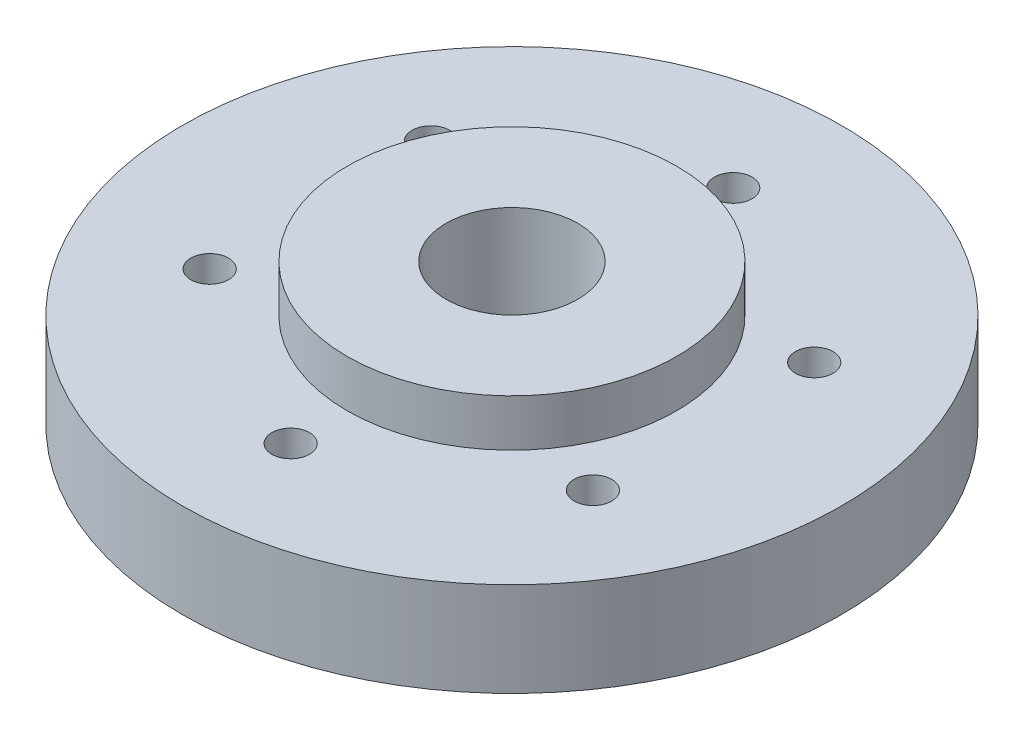
ISO-10303-21;
HEADER;
FILE_DESCRIPTION(('STEP AP214'),'2;1');
FILE_NAME('part.step','',(''),(''),'','','');
FILE_SCHEMA(('AUTOMOTIVE_DESIGN { 1 0 10303 214 1 1 1 1 }'));
ENDSEC;
DATA;
#1=APPLICATION_CONTEXT('core data for automotive mechanical design processes');
#2=APPLICATION_PROTOCOL_DEFINITION('international standard','automotive_design',2000,#1);
#3=PRODUCT_CONTEXT('',#1,'mechanical');
#4=PRODUCT('Part','Part','',(#3));
#5=PRODUCT_RELATED_PRODUCT_CATEGORY('part','',(#4));
#6=PRODUCT_DEFINITION_FORMATION('','',#4);
#7=PRODUCT_DEFINITION_CONTEXT('part definition',#1,'design');
#8=PRODUCT_DEFINITION('design','',#6,#7);
#9=PRODUCT_DEFINITION_SHAPE('','',#8);
#10=(LENGTH_UNIT() NAMED_UNIT(*) SI_UNIT(.MILLI.,.METRE.));
#11=(NAMED_UNIT(*) PLANE_ANGLE_UNIT() SI_UNIT($,.RADIAN.));
#12=(NAMED_UNIT(*) SI_UNIT($,.STERADIAN.) SOLID_ANGLE_UNIT());
#13=UNCERTAINTY_MEASURE_WITH_UNIT(LENGTH_MEASURE(1.E-05),#10,'distance_accuracy_value','');
#14=(GEOMETRIC_REPRESENTATION_CONTEXT(3) GLOBAL_UNCERTAINTY_ASSIGNED_CONTEXT((#13)) GLOBAL_UNIT_ASSIGNED_CONTEXT((#10,
#11,#12)) REPRESENTATION_CONTEXT('',''));
#15=CARTESIAN_POINT('',(0.,0.,0.));
#16=DIRECTION('',(0.,0.,1.));
#17=DIRECTION('',(1.,0.,0.));
#18=AXIS2_PLACEMENT_3D('',#15,#16,#17);
#19=CARTESIAN_POINT('',(0.,0.,-23.5));
#20=DIRECTION('',(0.,1.,0.));
#21=DIRECTION('',(0.,0.,1.));
#22=AXIS2_PLACEMENT_3D('',#19,#20,#21);
#23=CYLINDRICAL_SURFACE('',#22,2.);
#24=CARTESIAN_POINT('',(0.,10.,-23.5));
#25=DIRECTION('',(0.,1.,0.));
#26=DIRECTION('',(0.,0.,1.));
#27=AXIS2_PLACEMENT_3D('',#24,#25,#26);
#28=CIRCLE('',#27,2.);
#29=CARTESIAN_POINT('',(0.,10.,-21.5));
#30=VERTEX_POINT('',#29);
#31=EDGE_CURVE('E61',#30,#30,#28,.T.);
#32=ORIENTED_EDGE('',*,*,#31,.T.);
#33=EDGE_LOOP('',(#32));
#34=FACE_BOUND('',#33,.T.);
#35=CARTESIAN_POINT('',(0.,5.,-23.5));
#36=DIRECTION('',(0.,-1.,0.));
#37=DIRECTION('',(0.,0.,-1.));
#38=AXIS2_PLACEMENT_3D('',#35,#36,#37);
#39=CIRCLE('',#38,2.);
#40=CARTESIAN_POINT('',(0.,5.,-25.5));
#41=VERTEX_POINT('',#40);
#42=EDGE_CURVE('E107',#41,#41,#39,.T.);
#43=ORIENTED_EDGE('',*,*,#42,.T.);
#44=EDGE_LOOP('',(#43));
#45=FACE_BOUND('',#44,.T.);
#46=ADVANCED_FACE('F31',(#34,#45),#23,.F.);
#47=CARTESIAN_POINT('',(-20.3515969889338,0.,-11.7499999999991));
#48=DIRECTION('',(0.,1.,0.));
#49=DIRECTION('',(0.,0.,1.));
#50=AXIS2_PLACEMENT_3D('',#47,#48,#49);
#51=CYLINDRICAL_SURFACE('',#50,2.00000000000101);
#52=CARTESIAN_POINT('',(-20.3515969889338,10.,-11.7499999999991));
#53=DIRECTION('',(0.,1.,0.));
#54=DIRECTION('',(0.,0.,1.));
#55=AXIS2_PLACEMENT_3D('',#52,#53,#54);
#56=CIRCLE('',#55,2.00000000000101);
#57=CARTESIAN_POINT('',(-20.3515969889338,10.,-9.74999999999811));
#58=VERTEX_POINT('',#57);
#59=EDGE_CURVE('E67',#58,#58,#56,.T.);
#60=ORIENTED_EDGE('',*,*,#59,.T.);
#61=EDGE_LOOP('',(#60));
#62=FACE_BOUND('',#61,.T.);
#63=CARTESIAN_POINT('',(-20.3515969889338,5.,-11.7499999999991));
#64=DIRECTION('',(0.,-1.,0.));
#65=DIRECTION('',(0.,0.,-1.));
#66=AXIS2_PLACEMENT_3D('',#63,#64,#65);
#67=CIRCLE('',#66,2.00000000000101);
#68=CARTESIAN_POINT('',(-20.3515969889338,5.,-13.7500000000001));
#69=VERTEX_POINT('',#68);
#70=EDGE_CURVE('E98',#69,#69,#67,.T.);
#71=ORIENTED_EDGE('',*,*,#70,.T.);
#72=EDGE_LOOP('',(#71));
#73=FACE_BOUND('',#72,.T.);
#74=ADVANCED_FACE('F182',(#62,#73),#51,.F.);
#75=CARTESIAN_POINT('',(-20.3515969889328,0.,11.7500000000009));
#76=DIRECTION('',(0.,1.,0.));
#77=DIRECTION('',(0.,0.,1.));
#78=AXIS2_PLACEMENT_3D('',#75,#76,#77);
#79=CYLINDRICAL_SURFACE('',#78,2.0000000000019);
#80=CARTESIAN_POINT('',(-20.3515969889328,10.,11.7500000000009));
#81=DIRECTION('',(0.,1.,0.));
#82=DIRECTION('',(0.,0.,1.));
#83=AXIS2_PLACEMENT_3D('',#80,#81,#82);
#84=CIRCLE('',#83,2.0000000000019);
#85=CARTESIAN_POINT('',(-20.3515969889328,10.,13.7500000000028));
#86=VERTEX_POINT('',#85);
#87=EDGE_CURVE('E70',#86,#86,#84,.T.);
#88=ORIENTED_EDGE('',*,*,#87,.T.);
#89=EDGE_LOOP('',(#88));
#90=FACE_BOUND('',#89,.T.);
#91=CARTESIAN_POINT('',(-20.3515969889328,5.,11.7500000000009));
#92=DIRECTION('',(0.,-1.,0.));
#93=DIRECTION('',(0.,0.,-1.));
#94=AXIS2_PLACEMENT_3D('',#91,#92,#93);
#95=CIRCLE('',#94,2.0000000000019);
#96=CARTESIAN_POINT('',(-20.3515969889328,5.,9.74999999999897));
#97=VERTEX_POINT('',#96);
#98=EDGE_CURVE('E95',#97,#97,#95,.T.);
#99=ORIENTED_EDGE('',*,*,#98,.T.);
#100=EDGE_LOOP('',(#99));
#101=FACE_BOUND('',#100,.T.);
#102=ADVANCED_FACE('F188',(#90,#101),#79,.F.);
#103=CARTESIAN_POINT('',(20.3515969889358,0.,11.7499999999991));
#104=DIRECTION('',(0.,1.,0.));
#105=DIRECTION('',(0.,0.,1.));
#106=AXIS2_PLACEMENT_3D('',#103,#104,#105);
#107=CYLINDRICAL_SURFACE('',#106,2.00000000000129);
#108=CARTESIAN_POINT('',(20.3515969889358,10.,11.7499999999991));
#109=DIRECTION('',(0.,1.,0.));
#110=DIRECTION('',(0.,0.,1.));
#111=AXIS2_PLACEMENT_3D('',#108,#109,#110);
#112=CIRCLE('',#111,2.00000000000129);
#113=CARTESIAN_POINT('',(20.3515969889358,10.,13.7500000000004));
#114=VERTEX_POINT('',#113);
#115=EDGE_CURVE('E77',#114,#114,#112,.T.);
#116=ORIENTED_EDGE('',*,*,#115,.T.);
#117=EDGE_LOOP('',(#116));
#118=FACE_BOUND('',#117,.T.);
#119=CARTESIAN_POINT('',(20.3515969889358,5.,11.7499999999991));
#120=DIRECTION('',(0.,-1.,0.));
#121=DIRECTION('',(0.,0.,-1.));
#122=AXIS2_PLACEMENT_3D('',#119,#120,#121);
#123=CIRCLE('',#122,2.00000000000129);
#124=CARTESIAN_POINT('',(20.3515969889358,5.,9.74999999999784));
#125=VERTEX_POINT('',#124);
#126=EDGE_CURVE('E125',#125,#125,#123,.T.);
#127=ORIENTED_EDGE('',*,*,#126,.T.);
#128=EDGE_LOOP('',(#127));
#129=FACE_BOUND('',#128,.T.);
#130=ADVANCED_FACE('F136',(#118,#129),#107,.F.);
#131=CARTESIAN_POINT('',(20.3515969889348,0.,-11.7500000000009));
#132=DIRECTION('',(0.,1.,0.));
#133=DIRECTION('',(0.,0.,1.));
#134=AXIS2_PLACEMENT_3D('',#131,#132,#133);
#135=CYLINDRICAL_SURFACE('',#134,2.00000000000028);
#136=CARTESIAN_POINT('',(20.3515969889348,10.,-11.7500000000009));
#137=DIRECTION('',(0.,1.,0.));
#138=DIRECTION('',(0.,0.,1.));
#139=AXIS2_PLACEMENT_3D('',#136,#137,#138);
#140=CIRCLE('',#139,2.00000000000028);
#141=CARTESIAN_POINT('',(20.3515969889348,10.,-9.75000000000058));
#142=VERTEX_POINT('',#141);
#143=EDGE_CURVE('E66',#142,#142,#140,.T.);
#144=ORIENTED_EDGE('',*,*,#143,.T.);
#145=EDGE_LOOP('',(#144));
#146=FACE_BOUND('',#145,.T.);
#147=CARTESIAN_POINT('',(20.3515969889348,5.,-11.7500000000009));
#148=DIRECTION('',(0.,-1.,0.));
#149=DIRECTION('',(0.,0.,-1.));
#150=AXIS2_PLACEMENT_3D('',#147,#148,#149);
#151=CIRCLE('',#150,2.00000000000028);
#152=CARTESIAN_POINT('',(20.3515969889348,5.,-13.7500000000011));
#153=VERTEX_POINT('',#152);
#154=EDGE_CURVE('E116',#153,#153,#151,.T.);
#155=ORIENTED_EDGE('',*,*,#154,.T.);
#156=EDGE_LOOP('',(#155));
#157=FACE_BOUND('',#156,.T.);
#158=ADVANCED_FACE('F222',(#146,#157),#135,.F.);
#159=CARTESIAN_POINT('',(1.99797467488749E-12,0.,23.5));
#160=DIRECTION('',(0.,1.,0.));
#161=DIRECTION('',(0.,0.,1.));
#162=AXIS2_PLACEMENT_3D('',#159,#160,#161);
#163=CYLINDRICAL_SURFACE('',#162,2.00000000000207);
#164=CARTESIAN_POINT('',(1.99797467488749E-12,10.,23.5));
#165=DIRECTION('',(0.,1.,0.));
#166=DIRECTION('',(0.,0.,1.));
#167=AXIS2_PLACEMENT_3D('',#164,#165,#166);
#168=CIRCLE('',#167,2.00000000000207);
#169=CARTESIAN_POINT('',(1.99797467488749E-12,10.,25.5000000000021));
#170=VERTEX_POINT('',#169);
#171=EDGE_CURVE('E74',#170,#170,#168,.T.);
#172=ORIENTED_EDGE('',*,*,#171,.T.);
#173=EDGE_LOOP('',(#172));
#174=FACE_BOUND('',#173,.T.);
#175=CARTESIAN_POINT('',(1.99797467488749E-12,5.,23.5));
#176=DIRECTION('',(0.,-1.,0.));
#177=DIRECTION('',(0.,0.,-1.));
#178=AXIS2_PLACEMENT_3D('',#175,#176,#177);
#179=CIRCLE('',#178,2.00000000000207);
#180=CARTESIAN_POINT('',(1.99797467488749E-12,5.,21.4999999999979));
#181=VERTEX_POINT('',#180);
#182=EDGE_CURVE('E85',#181,#181,#179,.T.);
#183=ORIENTED_EDGE('',*,*,#182,.T.);
#184=EDGE_LOOP('',(#183));
#185=FACE_BOUND('',#184,.T.);
#186=ADVANCED_FACE('F218',(#174,#185),#163,.F.);
#187=CARTESIAN_POINT('',(0.,15.,0.));
#188=DIRECTION('',(0.,-1.,0.));
#189=DIRECTION('',(0.,0.,-1.));
#190=AXIS2_PLACEMENT_3D('',#187,#188,#189);
#191=CYLINDRICAL_SURFACE('',#190,35.);
#192=CARTESIAN_POINT('',(0.,0.,0.));
#193=DIRECTION('',(0.,1.,0.));
#194=DIRECTION('',(0.,0.,1.));
#195=AXIS2_PLACEMENT_3D('',#192,#193,#194);
#196=CIRCLE('',#195,35.);
#197=CARTESIAN_POINT('',(0.,0.,35.));
#198=VERTEX_POINT('',#197);
#199=EDGE_CURVE('E10',#198,#198,#196,.T.);
#200=ORIENTED_EDGE('',*,*,#199,.T.);
#201=EDGE_LOOP('',(#200));
#202=FACE_BOUND('',#201,.T.);
#203=CARTESIAN_POINT('',(0.,10.,0.));
#204=DIRECTION('',(0.,1.,0.));
#205=DIRECTION('',(0.,0.,1.));
#206=AXIS2_PLACEMENT_3D('',#203,#204,#205);
#207=CIRCLE('',#206,35.);
#208=CARTESIAN_POINT('',(0.,10.,35.));
#209=VERTEX_POINT('',#208);
#210=EDGE_CURVE('E52',#209,#209,#207,.T.);
#211=ORIENTED_EDGE('',*,*,#210,.F.);
#212=EDGE_LOOP('',(#211));
#213=FACE_BOUND('',#212,.T.);
#214=ADVANCED_FACE('F33',(#202,#213),#191,.T.);
#215=CARTESIAN_POINT('',(0.,15.,0.));
#216=DIRECTION('',(0.,1.,0.));
#217=DIRECTION('',(0.,0.,1.));
#218=AXIS2_PLACEMENT_3D('',#215,#216,#217);
#219=PLANE('',#218);
#220=CARTESIAN_POINT('',(0.,15.,0.));
#221=DIRECTION('',(0.,-1.,0.));
#222=DIRECTION('',(0.,0.,-1.));
#223=AXIS2_PLACEMENT_3D('',#220,#221,#222);
#224=CIRCLE('',#223,7.);
#225=CARTESIAN_POINT('',(0.,15.,-7.));
#226=VERTEX_POINT('',#225);
#227=EDGE_CURVE('E47',#226,#226,#224,.T.);
#228=ORIENTED_EDGE('',*,*,#227,.T.);
#229=EDGE_LOOP('',(#228));
#230=FACE_BOUND('',#229,.T.);
#231=CARTESIAN_POINT('',(0.,15.,0.));
#232=DIRECTION('',(0.,1.,0.));
#233=DIRECTION('',(0.,0.,1.));
#234=AXIS2_PLACEMENT_3D('',#231,#232,#233);
#235=CIRCLE('',#234,17.5);
#236=CARTESIAN_POINT('',(0.,15.,17.5));
#237=VERTEX_POINT('',#236);
#238=EDGE_CURVE('E58',#237,#237,#235,.T.);
#239=ORIENTED_EDGE('',*,*,#238,.T.);
#240=EDGE_LOOP('',(#239));
#241=FACE_BOUND('',#240,.T.);
#242=ADVANCED_FACE('F156',(#230,#241),#219,.T.);
#243=CARTESIAN_POINT('',(0.,0.,0.));
#244=DIRECTION('',(0.,1.,0.));
#245=DIRECTION('',(0.,0.,1.));
#246=AXIS2_PLACEMENT_3D('',#243,#244,#245);
#247=PLANE('',#246);
#248=CARTESIAN_POINT('',(20.3515969889358,0.,11.7499999999991));
#249=DIRECTION('',(0.,-1.,0.));
#250=DIRECTION('',(0.,0.,-1.));
#251=AXIS2_PLACEMENT_3D('',#248,#249,#250);
#252=CIRCLE('',#251,5.00000000000029);
#253=CARTESIAN_POINT('',(20.3515969889358,0.,6.74999999999884));
#254=VERTEX_POINT('',#253);
#255=EDGE_CURVE('E128',#254,#254,#252,.T.);
#256=ORIENTED_EDGE('',*,*,#255,.F.);
#257=EDGE_LOOP('',(#256));
#258=FACE_BOUND('',#257,.T.);
#259=CARTESIAN_POINT('',(20.3515969889348,0.,-11.7500000000009));
#260=DIRECTION('',(0.,-1.,0.));
#261=DIRECTION('',(0.,0.,-1.));
#262=AXIS2_PLACEMENT_3D('',#259,#260,#261);
#263=CIRCLE('',#262,5.00000000000128);
#264=CARTESIAN_POINT('',(20.3515969889348,0.,-16.7500000000021));
#265=VERTEX_POINT('',#264);
#266=EDGE_CURVE('E119',#265,#265,#263,.T.);
#267=ORIENTED_EDGE('',*,*,#266,.F.);
#268=EDGE_LOOP('',(#267));
#269=FACE_BOUND('',#268,.T.);
#270=CARTESIAN_POINT('',(0.,0.,-23.5));
#271=DIRECTION('',(0.,-1.,0.));
#272=DIRECTION('',(0.,0.,-1.));
#273=AXIS2_PLACEMENT_3D('',#270,#271,#272);
#274=CIRCLE('',#273,5.00000000000206);
#275=CARTESIAN_POINT('',(0.,0.,-28.5000000000021));
#276=VERTEX_POINT('',#275);
#277=EDGE_CURVE('E110',#276,#276,#274,.T.);
#278=ORIENTED_EDGE('',*,*,#277,.F.);
#279=EDGE_LOOP('',(#278));
#280=FACE_BOUND('',#279,.T.);
#281=CARTESIAN_POINT('',(-20.3515969889338,0.,-11.7499999999991));
#282=DIRECTION('',(0.,-1.,0.));
#283=DIRECTION('',(0.,0.,-1.));
#284=AXIS2_PLACEMENT_3D('',#281,#282,#283);
#285=CIRCLE('',#284,5.00000000000189);
#286=CARTESIAN_POINT('',(-20.3515969889338,0.,-16.750000000001));
#287=VERTEX_POINT('',#286);
#288=EDGE_CURVE('E101',#287,#287,#285,.T.);
#289=ORIENTED_EDGE('',*,*,#288,.F.);
#290=EDGE_LOOP('',(#289));
#291=FACE_BOUND('',#290,.T.);
#292=CARTESIAN_POINT('',(-20.3515969889328,0.,11.7500000000009));
#293=DIRECTION('',(0.,-1.,0.));
#294=DIRECTION('',(0.,0.,-1.));
#295=AXIS2_PLACEMENT_3D('',#292,#293,#294);
#296=CIRCLE('',#295,5.00000000000101);
#297=CARTESIAN_POINT('',(-20.3515969889328,0.,6.74999999999985));
#298=VERTEX_POINT('',#297);
#299=EDGE_CURVE('E91',#298,#298,#296,.T.);
#300=ORIENTED_EDGE('',*,*,#299,.F.);
#301=EDGE_LOOP('',(#300));
#302=FACE_BOUND('',#301,.T.);
#303=CARTESIAN_POINT('',(1.99797467488749E-12,0.,23.5));
#304=DIRECTION('',(0.,-1.,0.));
#305=DIRECTION('',(0.,0.,-1.));
#306=AXIS2_PLACEMENT_3D('',#303,#304,#305);
#307=CIRCLE('',#306,5.);
#308=CARTESIAN_POINT('',(1.99797467488749E-12,0.,18.5));
#309=VERTEX_POINT('',#308);
#310=EDGE_CURVE('E82',#309,#309,#307,.T.);
#311=ORIENTED_EDGE('',*,*,#310,.F.);
#312=EDGE_LOOP('',(#311));
#313=FACE_BOUND('',#312,.T.);
#314=CARTESIAN_POINT('',(0.,0.,0.));
#315=DIRECTION('',(0.,-1.,0.));
#316=DIRECTION('',(0.,0.,-1.));
#317=AXIS2_PLACEMENT_3D('',#314,#315,#316);
#318=CIRCLE('',#317,15.75);
#319=CARTESIAN_POINT('',(0.,0.,-15.75));
#320=VERTEX_POINT('',#319);
#321=EDGE_CURVE('E42',#320,#320,#318,.T.);
#322=ORIENTED_EDGE('',*,*,#321,.F.);
#323=EDGE_LOOP('',(#322));
#324=FACE_BOUND('',#323,.T.);
#325=ORIENTED_EDGE('',*,*,#199,.F.);
#326=EDGE_LOOP('',(#325));
#327=FACE_BOUND('',#326,.T.);
#328=ADVANCED_FACE('F152',(#258,#269,#280,#291,#302,#313,#324,#327),#247,.F.);
#329=CARTESIAN_POINT('',(0.,5.,0.));
#330=DIRECTION('',(0.,-1.,0.));
#331=DIRECTION('',(0.,0.,-1.));
#332=AXIS2_PLACEMENT_3D('',#329,#330,#331);
#333=CYLINDRICAL_SURFACE('',#332,15.75);
#334=CARTESIAN_POINT('',(0.,5.,0.));
#335=DIRECTION('',(0.,-1.,0.));
#336=DIRECTION('',(0.,0.,-1.));
#337=AXIS2_PLACEMENT_3D('',#334,#335,#336);
#338=CIRCLE('',#337,15.75);
#339=CARTESIAN_POINT('',(0.,5.,-15.75));
#340=VERTEX_POINT('',#339);
#341=EDGE_CURVE('E38',#340,#340,#338,.T.);
#342=ORIENTED_EDGE('',*,*,#341,.F.);
#343=EDGE_LOOP('',(#342));
#344=FACE_BOUND('',#343,.T.);
#345=ORIENTED_EDGE('',*,*,#321,.T.);
#346=EDGE_LOOP('',(#345));
#347=FACE_BOUND('',#346,.T.);
#348=ADVANCED_FACE('F155',(#344,#347),#333,.F.);
#349=CARTESIAN_POINT('',(0.,5.,0.));
#350=DIRECTION('',(0.,-1.,0.));
#351=DIRECTION('',(0.,0.,-1.));
#352=AXIS2_PLACEMENT_3D('',#349,#350,#351);
#353=PLANE('',#352);
#354=CARTESIAN_POINT('',(0.,5.,0.));
#355=DIRECTION('',(0.,-1.,0.));
#356=DIRECTION('',(0.,0.,-1.));
#357=AXIS2_PLACEMENT_3D('',#354,#355,#356);
#358=CIRCLE('',#357,7.);
#359=CARTESIAN_POINT('',(0.,5.,-7.));
#360=VERTEX_POINT('',#359);
#361=EDGE_CURVE('E49',#360,#360,#358,.T.);
#362=ORIENTED_EDGE('',*,*,#361,.F.);
#363=EDGE_LOOP('',(#362));
#364=FACE_BOUND('',#363,.T.);
#365=ORIENTED_EDGE('',*,*,#341,.T.);
#366=EDGE_LOOP('',(#365));
#367=FACE_BOUND('',#366,.T.);
#368=ADVANCED_FACE('F171',(#364,#367),#353,.T.);
#369=CARTESIAN_POINT('',(0.,15.,0.));
#370=DIRECTION('',(0.,-1.,0.));
#371=DIRECTION('',(0.,0.,-1.));
#372=AXIS2_PLACEMENT_3D('',#369,#370,#371);
#373=CYLINDRICAL_SURFACE('',#372,7.);
#374=ORIENTED_EDGE('',*,*,#227,.F.);
#375=EDGE_LOOP('',(#374));
#376=FACE_BOUND('',#375,.T.);
#377=ORIENTED_EDGE('',*,*,#361,.T.);
#378=EDGE_LOOP('',(#377));
#379=FACE_BOUND('',#378,.T.);
#380=ADVANCED_FACE('F177',(#376,#379),#373,.F.);
#381=CARTESIAN_POINT('',(0.,10.,0.));
#382=DIRECTION('',(0.,1.,0.));
#383=DIRECTION('',(0.,0.,1.));
#384=AXIS2_PLACEMENT_3D('',#381,#382,#383);
#385=PLANE('',#384);
#386=ORIENTED_EDGE('',*,*,#143,.F.);
#387=EDGE_LOOP('',(#386));
#388=FACE_BOUND('',#387,.T.);
#389=ORIENTED_EDGE('',*,*,#115,.F.);
#390=EDGE_LOOP('',(#389));
#391=FACE_BOUND('',#390,.T.);
#392=ORIENTED_EDGE('',*,*,#171,.F.);
#393=EDGE_LOOP('',(#392));
#394=FACE_BOUND('',#393,.T.);
#395=ORIENTED_EDGE('',*,*,#87,.F.);
#396=EDGE_LOOP('',(#395));
#397=FACE_BOUND('',#396,.T.);
#398=ORIENTED_EDGE('',*,*,#59,.F.);
#399=EDGE_LOOP('',(#398));
#400=FACE_BOUND('',#399,.T.);
#401=ORIENTED_EDGE('',*,*,#31,.F.);
#402=EDGE_LOOP('',(#401));
#403=FACE_BOUND('',#402,.T.);
#404=CARTESIAN_POINT('',(0.,10.,0.));
#405=DIRECTION('',(0.,1.,0.));
#406=DIRECTION('',(0.,0.,1.));
#407=AXIS2_PLACEMENT_3D('',#404,#405,#406);
#408=CIRCLE('',#407,17.5);
#409=CARTESIAN_POINT('',(0.,10.,17.5));
#410=VERTEX_POINT('',#409);
#411=EDGE_CURVE('E57',#410,#410,#408,.T.);
#412=ORIENTED_EDGE('',*,*,#411,.F.);
#413=EDGE_LOOP('',(#412));
#414=FACE_BOUND('',#413,.T.);
#415=ORIENTED_EDGE('',*,*,#210,.T.);
#416=EDGE_LOOP('',(#415));
#417=FACE_BOUND('',#416,.T.);
#418=ADVANCED_FACE('F198',(#388,#391,#394,#397,#400,#403,#414,#417),#385,.T.);
#419=CARTESIAN_POINT('',(0.,10.,0.));
#420=DIRECTION('',(0.,1.,0.));
#421=DIRECTION('',(0.,0.,1.));
#422=AXIS2_PLACEMENT_3D('',#419,#420,#421);
#423=CYLINDRICAL_SURFACE('',#422,17.5);
#424=ORIENTED_EDGE('',*,*,#411,.T.);
#425=EDGE_LOOP('',(#424));
#426=FACE_BOUND('',#425,.T.);
#427=ORIENTED_EDGE('',*,*,#238,.F.);
#428=EDGE_LOOP('',(#427));
#429=FACE_BOUND('',#428,.T.);
#430=ADVANCED_FACE('F194',(#426,#429),#423,.T.);
#431=CARTESIAN_POINT('',(1.99797467488749E-12,5.,23.5));
#432=DIRECTION('',(0.,-1.,0.));
#433=DIRECTION('',(0.,0.,-1.));
#434=AXIS2_PLACEMENT_3D('',#431,#432,#433);
#435=CYLINDRICAL_SURFACE('',#434,5.);
#436=CARTESIAN_POINT('',(1.99797467488749E-12,5.,23.5));
#437=DIRECTION('',(0.,-1.,0.));
#438=DIRECTION('',(0.,0.,-1.));
#439=AXIS2_PLACEMENT_3D('',#436,#437,#438);
#440=CIRCLE('',#439,5.);
#441=CARTESIAN_POINT('',(1.99797467488749E-12,5.,18.5));
#442=VERTEX_POINT('',#441);
#443=EDGE_CURVE('E71',#442,#442,#440,.T.);
#444=ORIENTED_EDGE('',*,*,#443,.F.);
#445=EDGE_LOOP('',(#444));
#446=FACE_BOUND('',#445,.T.);
#447=ORIENTED_EDGE('',*,*,#310,.T.);
#448=EDGE_LOOP('',(#447));
#449=FACE_BOUND('',#448,.T.);
#450=ADVANCED_FACE('F197',(#446,#449),#435,.F.);
#451=CARTESIAN_POINT('',(1.99797467488749E-12,5.,23.5));
#452=DIRECTION('',(0.,-1.,0.));
#453=DIRECTION('',(0.,0.,-1.));
#454=AXIS2_PLACEMENT_3D('',#451,#452,#453);
#455=PLANE('',#454);
#456=ORIENTED_EDGE('',*,*,#182,.F.);
#457=EDGE_LOOP('',(#456));
#458=FACE_BOUND('',#457,.T.);
#459=ORIENTED_EDGE('',*,*,#443,.T.);
#460=EDGE_LOOP('',(#459));
#461=FACE_BOUND('',#460,.T.);
#462=ADVANCED_FACE('F259',(#458,#461),#455,.T.);
#463=CARTESIAN_POINT('',(20.3515969889348,5.,-11.7500000000009));
#464=DIRECTION('',(0.,-1.,0.));
#465=DIRECTION('',(0.,0.,-1.));
#466=AXIS2_PLACEMENT_3D('',#463,#464,#465);
#467=CYLINDRICAL_SURFACE('',#466,5.00000000000128);
#468=CARTESIAN_POINT('',(20.3515969889348,5.,-11.7500000000009));
#469=DIRECTION('',(0.,-1.,0.));
#470=DIRECTION('',(0.,0.,-1.));
#471=AXIS2_PLACEMENT_3D('',#468,#469,#470);
#472=CIRCLE('',#471,5.00000000000128);
#473=CARTESIAN_POINT('',(20.3515969889348,5.,-16.7500000000021));
#474=VERTEX_POINT('',#473);
#475=EDGE_CURVE('E122',#474,#474,#472,.T.);
#476=ORIENTED_EDGE('',*,*,#475,.F.);
#477=EDGE_LOOP('',(#476));
#478=FACE_BOUND('',#477,.T.);
#479=ORIENTED_EDGE('',*,*,#266,.T.);
#480=EDGE_LOOP('',(#479));
#481=FACE_BOUND('',#480,.T.);
#482=ADVANCED_FACE('F262',(#478,#481),#467,.F.);
#483=CARTESIAN_POINT('',(20.3515969889348,5.,-11.7500000000009));
#484=DIRECTION('',(0.,-1.,0.));
#485=DIRECTION('',(0.,0.,-1.));
#486=AXIS2_PLACEMENT_3D('',#483,#484,#485);
#487=PLANE('',#486);
#488=ORIENTED_EDGE('',*,*,#154,.F.);
#489=EDGE_LOOP('',(#488));
#490=FACE_BOUND('',#489,.T.);
#491=ORIENTED_EDGE('',*,*,#475,.T.);
#492=EDGE_LOOP('',(#491));
#493=FACE_BOUND('',#492,.T.);
#494=ADVANCED_FACE('F148',(#490,#493),#487,.T.);
#495=CARTESIAN_POINT('',(20.3515969889358,5.,11.7499999999991));
#496=DIRECTION('',(0.,-1.,0.));
#497=DIRECTION('',(0.,0.,-1.));
#498=AXIS2_PLACEMENT_3D('',#495,#496,#497);
#499=CYLINDRICAL_SURFACE('',#498,5.00000000000029);
#500=CARTESIAN_POINT('',(20.3515969889358,5.,11.7499999999991));
#501=DIRECTION('',(0.,-1.,0.));
#502=DIRECTION('',(0.,0.,-1.));
#503=AXIS2_PLACEMENT_3D('',#500,#501,#502);
#504=CIRCLE('',#503,5.00000000000029);
#505=CARTESIAN_POINT('',(20.3515969889358,5.,6.74999999999884));
#506=VERTEX_POINT('',#505);
#507=EDGE_CURVE('E90',#506,#506,#504,.T.);
#508=ORIENTED_EDGE('',*,*,#507,.F.);
#509=EDGE_LOOP('',(#508));
#510=FACE_BOUND('',#509,.T.);
#511=ORIENTED_EDGE('',*,*,#255,.T.);
#512=EDGE_LOOP('',(#511));
#513=FACE_BOUND('',#512,.T.);
#514=ADVANCED_FACE('F142',(#510,#513),#499,.F.);
#515=CARTESIAN_POINT('',(20.3515969889358,5.,11.7499999999991));
#516=DIRECTION('',(0.,-1.,0.));
#517=DIRECTION('',(0.,0.,-1.));
#518=AXIS2_PLACEMENT_3D('',#515,#516,#517);
#519=PLANE('',#518);
#520=ORIENTED_EDGE('',*,*,#126,.F.);
#521=EDGE_LOOP('',(#520));
#522=FACE_BOUND('',#521,.T.);
#523=ORIENTED_EDGE('',*,*,#507,.T.);
#524=EDGE_LOOP('',(#523));
#525=FACE_BOUND('',#524,.T.);
#526=ADVANCED_FACE('F138',(#522,#525),#519,.T.);
#527=CARTESIAN_POINT('',(-20.3515969889328,5.,11.7500000000009));
#528=DIRECTION('',(0.,-1.,0.));
#529=DIRECTION('',(0.,0.,-1.));
#530=AXIS2_PLACEMENT_3D('',#527,#528,#529);
#531=CYLINDRICAL_SURFACE('',#530,5.00000000000101);
#532=CARTESIAN_POINT('',(-20.3515969889328,5.,11.7500000000009));
#533=DIRECTION('',(0.,-1.,0.));
#534=DIRECTION('',(0.,0.,-1.));
#535=AXIS2_PLACEMENT_3D('',#532,#533,#534);
#536=CIRCLE('',#535,5.00000000000101);
#537=CARTESIAN_POINT('',(-20.3515969889328,5.,6.74999999999985));
#538=VERTEX_POINT('',#537);
#539=EDGE_CURVE('E94',#538,#538,#536,.T.);
#540=ORIENTED_EDGE('',*,*,#539,.F.);
#541=EDGE_LOOP('',(#540));
#542=FACE_BOUND('',#541,.T.);
#543=ORIENTED_EDGE('',*,*,#299,.T.);
#544=EDGE_LOOP('',(#543));
#545=FACE_BOUND('',#544,.T.);
#546=ADVANCED_FACE('F141',(#542,#545),#531,.F.);
#547=CARTESIAN_POINT('',(-20.3515969889328,5.,11.7500000000009));
#548=DIRECTION('',(0.,-1.,0.));
#549=DIRECTION('',(0.,0.,-1.));
#550=AXIS2_PLACEMENT_3D('',#547,#548,#549);
#551=PLANE('',#550);
#552=ORIENTED_EDGE('',*,*,#98,.F.);
#553=EDGE_LOOP('',(#552));
#554=FACE_BOUND('',#553,.T.);
#555=ORIENTED_EDGE('',*,*,#539,.T.);
#556=EDGE_LOOP('',(#555));
#557=FACE_BOUND('',#556,.T.);
#558=ADVANCED_FACE('F245',(#554,#557),#551,.T.);
#559=CARTESIAN_POINT('',(-20.3515969889338,5.,-11.7499999999991));
#560=DIRECTION('',(0.,-1.,0.));
#561=DIRECTION('',(0.,0.,-1.));
#562=AXIS2_PLACEMENT_3D('',#559,#560,#561);
#563=CYLINDRICAL_SURFACE('',#562,5.00000000000189);
#564=CARTESIAN_POINT('',(-20.3515969889338,5.,-11.7499999999991));
#565=DIRECTION('',(0.,-1.,0.));
#566=DIRECTION('',(0.,0.,-1.));
#567=AXIS2_PLACEMENT_3D('',#564,#565,#566);
#568=CIRCLE('',#567,5.00000000000189);
#569=CARTESIAN_POINT('',(-20.3515969889338,5.,-16.750000000001));
#570=VERTEX_POINT('',#569);
#571=EDGE_CURVE('E104',#570,#570,#568,.T.);
#572=ORIENTED_EDGE('',*,*,#571,.F.);
#573=EDGE_LOOP('',(#572));
#574=FACE_BOUND('',#573,.T.);
#575=ORIENTED_EDGE('',*,*,#288,.T.);
#576=EDGE_LOOP('',(#575));
#577=FACE_BOUND('',#576,.T.);
#578=ADVANCED_FACE('F248',(#574,#577),#563,.F.);
#579=CARTESIAN_POINT('',(-20.3515969889338,5.,-11.7499999999991));
#580=DIRECTION('',(0.,-1.,0.));
#581=DIRECTION('',(0.,0.,-1.));
#582=AXIS2_PLACEMENT_3D('',#579,#580,#581);
#583=PLANE('',#582);
#584=ORIENTED_EDGE('',*,*,#70,.F.);
#585=EDGE_LOOP('',(#584));
#586=FACE_BOUND('',#585,.T.);
#587=ORIENTED_EDGE('',*,*,#571,.T.);
#588=EDGE_LOOP('',(#587));
#589=FACE_BOUND('',#588,.T.);
#590=ADVANCED_FACE('F319',(#586,#589),#583,.T.);
#591=CARTESIAN_POINT('',(0.,5.,-23.5));
#592=DIRECTION('',(0.,-1.,0.));
#593=DIRECTION('',(0.,0.,-1.));
#594=AXIS2_PLACEMENT_3D('',#591,#592,#593);
#595=CYLINDRICAL_SURFACE('',#594,5.00000000000206);
#596=CARTESIAN_POINT('',(0.,5.,-23.5));
#597=DIRECTION('',(0.,-1.,0.));
#598=DIRECTION('',(0.,0.,-1.));
#599=AXIS2_PLACEMENT_3D('',#596,#597,#598);
#600=CIRCLE('',#599,5.00000000000206);
#601=CARTESIAN_POINT('',(0.,5.,-28.5000000000021));
#602=VERTEX_POINT('',#601);
#603=EDGE_CURVE('E113',#602,#602,#600,.T.);
#604=ORIENTED_EDGE('',*,*,#603,.F.);
#605=EDGE_LOOP('',(#604));
#606=FACE_BOUND('',#605,.T.);
#607=ORIENTED_EDGE('',*,*,#277,.T.);
#608=EDGE_LOOP('',(#607));
#609=FACE_BOUND('',#608,.T.);
#610=ADVANCED_FACE('F328',(#606,#609),#595,.F.);
#611=CARTESIAN_POINT('',(0.,5.,-23.5));
#612=DIRECTION('',(0.,-1.,0.));
#613=DIRECTION('',(0.,0.,-1.));
#614=AXIS2_PLACEMENT_3D('',#611,#612,#613);
#615=PLANE('',#614);
#616=ORIENTED_EDGE('',*,*,#42,.F.);
#617=EDGE_LOOP('',(#616));
#618=FACE_BOUND('',#617,.T.);
#619=ORIENTED_EDGE('',*,*,#603,.T.);
#620=EDGE_LOOP('',(#619));
#621=FACE_BOUND('',#620,.T.);
#622=ADVANCED_FACE('F338',(#618,#621),#615,.T.);
#623=CLOSED_SHELL('',(#46,#74,#102,#130,#158,#186,#214,#242,#328,#348,#368,#380,#418,#430,#450,
#462,#482,#494,#514,#526,#546,#558,#578,#590,#610,#622));
#624=MANIFOLD_SOLID_BREP('B2',#623);
#625=ADVANCED_BREP_SHAPE_REPRESENTATION('',(#18,#624),#14);
#626=SHAPE_DEFINITION_REPRESENTATION(#9,#625);
ENDSEC;
END-ISO-10303-21;
